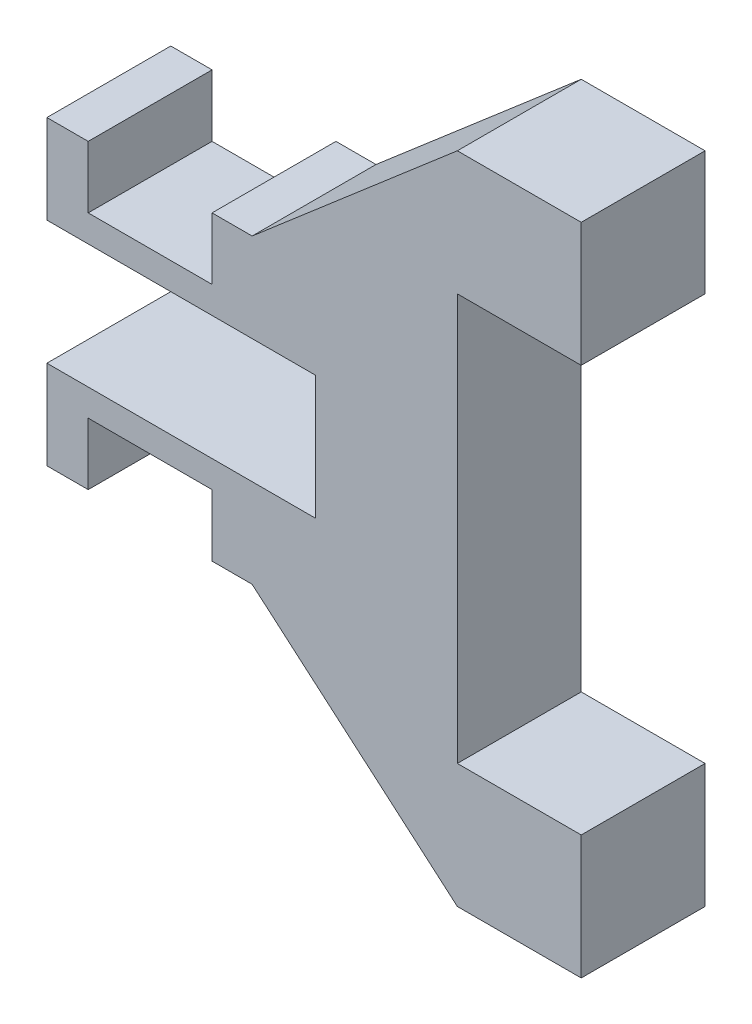
ISO-10303-21;
HEADER;
FILE_DESCRIPTION(('STEP AP214'),'2;1');
FILE_NAME('part.step','',(''),(''),'','','');
FILE_SCHEMA(('AUTOMOTIVE_DESIGN { 1 0 10303 214 1 1 1 1 }'));
ENDSEC;
DATA;
#1=APPLICATION_CONTEXT('core data for automotive mechanical design processes');
#2=APPLICATION_PROTOCOL_DEFINITION('international standard','automotive_design',2000,#1);
#3=PRODUCT_CONTEXT('',#1,'mechanical');
#4=PRODUCT('Part','Part','',(#3));
#5=PRODUCT_RELATED_PRODUCT_CATEGORY('part','',(#4));
#6=PRODUCT_DEFINITION_FORMATION('','',#4);
#7=PRODUCT_DEFINITION_CONTEXT('part definition',#1,'design');
#8=PRODUCT_DEFINITION('design','',#6,#7);
#9=PRODUCT_DEFINITION_SHAPE('','',#8);
#10=(LENGTH_UNIT() NAMED_UNIT(*) SI_UNIT(.MILLI.,.METRE.));
#11=(NAMED_UNIT(*) PLANE_ANGLE_UNIT() SI_UNIT($,.RADIAN.));
#12=(NAMED_UNIT(*) SI_UNIT($,.STERADIAN.) SOLID_ANGLE_UNIT());
#13=UNCERTAINTY_MEASURE_WITH_UNIT(LENGTH_MEASURE(1.E-05),#10,'distance_accuracy_value','');
#14=(GEOMETRIC_REPRESENTATION_CONTEXT(3) GLOBAL_UNCERTAINTY_ASSIGNED_CONTEXT((#13)) GLOBAL_UNIT_ASSIGNED_CONTEXT((#10,
#11,#12)) REPRESENTATION_CONTEXT('',''));
#15=CARTESIAN_POINT('',(0.,0.,0.));
#16=DIRECTION('',(0.,0.,1.));
#17=DIRECTION('',(1.,0.,0.));
#18=AXIS2_PLACEMENT_3D('',#15,#16,#17);
#19=CARTESIAN_POINT('',(54.4121763941234,-2.61735760170723,1.524));
#20=DIRECTION('',(0.,1.,0.));
#21=DIRECTION('',(0.,0.,1.));
#22=AXIS2_PLACEMENT_3D('',#19,#20,#21);
#23=PLANE('',#22);
#24=DIRECTION('',(0.,0.,1.));
#25=VECTOR('',#24,1.);
#26=CARTESIAN_POINT('',(54.9201763941234,-2.61735760170723,0.));
#27=LINE('',#26,#25);
#28=CARTESIAN_POINT('',(54.9201763941234,-2.61735760170723,0.));
#29=VERTEX_POINT('',#28);
#30=CARTESIAN_POINT('',(54.9201763941234,-2.61735760170723,1.524));
#31=VERTEX_POINT('',#30);
#32=EDGE_CURVE('E368',#29,#31,#27,.T.);
#33=ORIENTED_EDGE('',*,*,#32,.T.);
#34=DIRECTION('',(1.,0.,0.));
#35=VECTOR('',#34,1.);
#36=CARTESIAN_POINT('',(54.4121763941234,-2.61735760170723,1.524));
#37=LINE('',#36,#35);
#38=CARTESIAN_POINT('',(54.4121763941234,-2.61735760170723,1.524));
#39=VERTEX_POINT('',#38);
#40=EDGE_CURVE('E251',#39,#31,#37,.T.);
#41=ORIENTED_EDGE('',*,*,#40,.F.);
#42=DIRECTION('',(0.,0.,-1.));
#43=VECTOR('',#42,1.);
#44=CARTESIAN_POINT('',(54.4121763941234,-2.61735760170723,1.524));
#45=LINE('',#44,#43);
#46=CARTESIAN_POINT('',(54.4121763941234,-2.61735760170723,0.));
#47=VERTEX_POINT('',#46);
#48=EDGE_CURVE('E40',#39,#47,#45,.T.);
#49=ORIENTED_EDGE('',*,*,#48,.T.);
#50=DIRECTION('',(1.,0.,0.));
#51=VECTOR('',#50,1.);
#52=CARTESIAN_POINT('',(54.4121763941234,-2.61735760170723,0.));
#53=LINE('',#52,#51);
#54=EDGE_CURVE('E287',#47,#29,#53,.T.);
#55=ORIENTED_EDGE('',*,*,#54,.T.);
#56=EDGE_LOOP('',(#33,#41,#49,#55));
#57=FACE_BOUND('',#56,.T.);
#58=ADVANCED_FACE('F32',(#57),#23,.F.);
#59=DIRECTION('',(0.,0.,-1.));
#60=VECTOR('',#59,1.);
#61=CARTESIAN_POINT('',(56.4441763941234,-2.61735760170723,0.));
#62=LINE('',#61,#60);
#63=CARTESIAN_POINT('',(56.4441763941234,-2.61735760170723,1.524));
#64=VERTEX_POINT('',#63);
#65=CARTESIAN_POINT('',(56.4441763941234,-2.61735760170723,0.));
#66=VERTEX_POINT('',#65);
#67=EDGE_CURVE('E369',#64,#66,#62,.T.);
#68=ORIENTED_EDGE('',*,*,#67,.T.);
#69=CARTESIAN_POINT('',(56.9369583725451,-2.61735760170723,0.));
#70=VERTEX_POINT('',#69);
#71=EDGE_CURVE('E213',#66,#70,#53,.T.);
#72=ORIENTED_EDGE('',*,*,#71,.T.);
#73=DIRECTION('',(0.,0.,-1.));
#74=VECTOR('',#73,1.);
#75=CARTESIAN_POINT('',(56.9369583725451,-2.61735760170723,1.524));
#76=LINE('',#75,#74);
#77=CARTESIAN_POINT('',(56.9369583725451,-2.61735760170723,1.524));
#78=VERTEX_POINT('',#77);
#79=EDGE_CURVE('E355',#78,#70,#76,.T.);
#80=ORIENTED_EDGE('',*,*,#79,.F.);
#81=EDGE_CURVE('E250',#64,#78,#37,.T.);
#82=ORIENTED_EDGE('',*,*,#81,.F.);
#83=EDGE_LOOP('',(#68,#72,#80,#82));
#84=FACE_BOUND('',#83,.T.);
#85=ADVANCED_FACE('F461',(#84),#23,.F.);
#86=CARTESIAN_POINT('',(0.,0.,1.524));
#87=DIRECTION('',(0.,0.,1.));
#88=DIRECTION('',(1.,0.,0.));
#89=AXIS2_PLACEMENT_3D('',#86,#87,#88);
#90=PLANE('',#89);
#91=ORIENTED_EDGE('',*,*,#40,.T.);
#92=DIRECTION('',(0.,-1.,0.));
#93=VECTOR('',#92,1.);
#94=CARTESIAN_POINT('',(54.9201763941234,-1.85535760170723,1.524));
#95=LINE('',#94,#93);
#96=CARTESIAN_POINT('',(54.9201763941234,-1.85535760170723,1.524));
#97=VERTEX_POINT('',#96);
#98=EDGE_CURVE('E216',#97,#31,#95,.T.);
#99=ORIENTED_EDGE('',*,*,#98,.F.);
#100=DIRECTION('',(1.,0.,0.));
#101=VECTOR('',#100,1.);
#102=CARTESIAN_POINT('',(54.9201763941234,-1.85535760170723,1.524));
#103=LINE('',#102,#101);
#104=CARTESIAN_POINT('',(56.4441763941234,-1.85535760170723,1.524));
#105=VERTEX_POINT('',#104);
#106=EDGE_CURVE('E202',#97,#105,#103,.T.);
#107=ORIENTED_EDGE('',*,*,#106,.T.);
#108=DIRECTION('',(0.,-1.,0.));
#109=VECTOR('',#108,1.);
#110=CARTESIAN_POINT('',(56.4441763941234,-1.85535760170723,1.524));
#111=LINE('',#110,#109);
#112=EDGE_CURVE('E200',#105,#64,#111,.T.);
#113=ORIENTED_EDGE('',*,*,#112,.T.);
#114=ORIENTED_EDGE('',*,*,#81,.T.);
#115=DIRECTION('',(0.75832170522127,-0.651880503919472,0.));
#116=VECTOR('',#115,1.);
#117=CARTESIAN_POINT('',(56.9369583725451,-2.61735760170723,1.524));
#118=LINE('',#117,#116);
#119=CARTESIAN_POINT('',(59.4617403509667,-4.78775063812975,1.524));
#120=VERTEX_POINT('',#119);
#121=EDGE_CURVE('E254',#78,#120,#118,.T.);
#122=ORIENTED_EDGE('',*,*,#121,.T.);
#123=DIRECTION('',(1.,0.,0.));
#124=VECTOR('',#123,1.);
#125=CARTESIAN_POINT('',(59.4617403509667,-4.78775063812975,1.524));
#126=LINE('',#125,#124);
#127=CARTESIAN_POINT('',(60.9857403509667,-4.78775063812975,1.524));
#128=VERTEX_POINT('',#127);
#129=EDGE_CURVE('E256',#120,#128,#126,.T.);
#130=ORIENTED_EDGE('',*,*,#129,.T.);
#131=DIRECTION('',(0.,1.,0.));
#132=VECTOR('',#131,1.);
#133=CARTESIAN_POINT('',(60.9857403509667,-4.78775063812975,1.524));
#134=LINE('',#133,#132);
#135=CARTESIAN_POINT('',(60.9857403509667,-3.26375063812975,1.524));
#136=VERTEX_POINT('',#135);
#137=EDGE_CURVE('E258',#128,#136,#134,.T.);
#138=ORIENTED_EDGE('',*,*,#137,.T.);
#139=DIRECTION('',(-1.,0.,0.));
#140=VECTOR('',#139,1.);
#141=CARTESIAN_POINT('',(60.9857403509667,-3.26375063812975,1.524));
#142=LINE('',#141,#140);
#143=CARTESIAN_POINT('',(59.4617403509667,-3.26375063812975,1.524));
#144=VERTEX_POINT('',#143);
#145=EDGE_CURVE('E260',#136,#144,#142,.T.);
#146=ORIENTED_EDGE('',*,*,#145,.T.);
#147=DIRECTION('',(0.,1.,0.));
#148=VECTOR('',#147,1.);
#149=CARTESIAN_POINT('',(59.4617403509667,-3.26375063812975,1.524));
#150=LINE('',#149,#148);
#151=CARTESIAN_POINT('',(59.4617403509667,1.73975063812975,1.524));
#152=VERTEX_POINT('',#151);
#153=EDGE_CURVE('E262',#144,#152,#150,.T.);
#154=ORIENTED_EDGE('',*,*,#153,.T.);
#155=DIRECTION('',(1.,0.,0.));
#156=VECTOR('',#155,1.);
#157=CARTESIAN_POINT('',(60.9857403509667,1.73975063812975,1.524));
#158=LINE('',#157,#156);
#159=CARTESIAN_POINT('',(60.9857403509667,1.73975063812975,1.524));
#160=VERTEX_POINT('',#159);
#161=EDGE_CURVE('E264',#152,#160,#158,.T.);
#162=ORIENTED_EDGE('',*,*,#161,.T.);
#163=DIRECTION('',(0.,1.,0.));
#164=VECTOR('',#163,1.);
#165=CARTESIAN_POINT('',(60.9857403509667,3.26375063812975,1.524));
#166=LINE('',#165,#164);
#167=CARTESIAN_POINT('',(60.9857403509667,3.26375063812975,1.524));
#168=VERTEX_POINT('',#167);
#169=EDGE_CURVE('E266',#160,#168,#166,.T.);
#170=ORIENTED_EDGE('',*,*,#169,.T.);
#171=DIRECTION('',(-1.,0.,0.));
#172=VECTOR('',#171,1.);
#173=CARTESIAN_POINT('',(59.4617403509667,3.26375063812975,1.524));
#174=LINE('',#173,#172);
#175=CARTESIAN_POINT('',(59.4617403509667,3.26375063812975,1.524));
#176=VERTEX_POINT('',#175);
#177=EDGE_CURVE('E268',#168,#176,#174,.T.);
#178=ORIENTED_EDGE('',*,*,#177,.T.);
#179=DIRECTION('',(-0.758321705221271,-0.651880503919472,0.));
#180=VECTOR('',#179,1.);
#181=CARTESIAN_POINT('',(56.9369583725451,1.09335760170723,1.524));
#182=LINE('',#181,#180);
#183=CARTESIAN_POINT('',(56.9369583725451,1.09335760170723,1.524));
#184=VERTEX_POINT('',#183);
#185=EDGE_CURVE('E270',#176,#184,#182,.T.);
#186=ORIENTED_EDGE('',*,*,#185,.T.);
#187=DIRECTION('',(-1.,0.,0.));
#188=VECTOR('',#187,1.);
#189=CARTESIAN_POINT('',(54.4121763941234,1.09335760170723,1.524));
#190=LINE('',#189,#188);
#191=CARTESIAN_POINT('',(56.4441763941234,1.09335760170723,1.524));
#192=VERTEX_POINT('',#191);
#193=EDGE_CURVE('E273',#184,#192,#190,.T.);
#194=ORIENTED_EDGE('',*,*,#193,.T.);
#195=DIRECTION('',(0.,1.,0.));
#196=VECTOR('',#195,1.);
#197=CARTESIAN_POINT('',(56.4441763941234,0.331357601707228,1.524));
#198=LINE('',#197,#196);
#199=CARTESIAN_POINT('',(56.4441763941234,0.331357601707228,1.524));
#200=VERTEX_POINT('',#199);
#201=EDGE_CURVE('E240',#200,#192,#198,.T.);
#202=ORIENTED_EDGE('',*,*,#201,.F.);
#203=DIRECTION('',(1.,0.,0.));
#204=VECTOR('',#203,1.);
#205=CARTESIAN_POINT('',(54.9201763941234,0.331357601707228,1.524));
#206=LINE('',#205,#204);
#207=CARTESIAN_POINT('',(54.9201763941234,0.331357601707228,1.524));
#208=VERTEX_POINT('',#207);
#209=EDGE_CURVE('E224',#208,#200,#206,.T.);
#210=ORIENTED_EDGE('',*,*,#209,.F.);
#211=DIRECTION('',(0.,1.,0.));
#212=VECTOR('',#211,1.);
#213=CARTESIAN_POINT('',(54.9201763941234,0.331357601707228,1.524));
#214=LINE('',#213,#212);
#215=CARTESIAN_POINT('',(54.9201763941234,1.09335760170723,1.524));
#216=VERTEX_POINT('',#215);
#217=EDGE_CURVE('E230',#208,#216,#214,.T.);
#218=ORIENTED_EDGE('',*,*,#217,.T.);
#219=CARTESIAN_POINT('',(54.4121763941234,1.09335760170723,1.524));
#220=VERTEX_POINT('',#219);
#221=EDGE_CURVE('E272',#216,#220,#190,.T.);
#222=ORIENTED_EDGE('',*,*,#221,.T.);
#223=DIRECTION('',(0.,-1.,0.));
#224=VECTOR('',#223,1.);
#225=CARTESIAN_POINT('',(54.4121763941234,0.,1.524));
#226=LINE('',#225,#224);
#227=CARTESIAN_POINT('',(54.4121763941234,0.,1.524));
#228=VERTEX_POINT('',#227);
#229=EDGE_CURVE('E276',#220,#228,#226,.T.);
#230=ORIENTED_EDGE('',*,*,#229,.T.);
#231=DIRECTION('',(1.,0.,0.));
#232=VECTOR('',#231,1.);
#233=CARTESIAN_POINT('',(57.7184356935179,0.,1.524));
#234=LINE('',#233,#232);
#235=CARTESIAN_POINT('',(57.7184356935179,0.,1.524));
#236=VERTEX_POINT('',#235);
#237=EDGE_CURVE('E278',#228,#236,#234,.T.);
#238=ORIENTED_EDGE('',*,*,#237,.T.);
#239=DIRECTION('',(0.,-1.,0.));
#240=VECTOR('',#239,1.);
#241=CARTESIAN_POINT('',(57.7184356935179,0.,1.524));
#242=LINE('',#241,#240);
#243=CARTESIAN_POINT('',(57.7184356935179,-1.524,1.524));
#244=VERTEX_POINT('',#243);
#245=EDGE_CURVE('E280',#236,#244,#242,.T.);
#246=ORIENTED_EDGE('',*,*,#245,.T.);
#247=DIRECTION('',(-1.,0.,0.));
#248=VECTOR('',#247,1.);
#249=CARTESIAN_POINT('',(57.7184356935179,-1.524,1.524));
#250=LINE('',#249,#248);
#251=CARTESIAN_POINT('',(54.4121763941234,-1.524,1.524));
#252=VERTEX_POINT('',#251);
#253=EDGE_CURVE('E244',#244,#252,#250,.T.);
#254=ORIENTED_EDGE('',*,*,#253,.T.);
#255=DIRECTION('',(0.,-1.,0.));
#256=VECTOR('',#255,1.);
#257=CARTESIAN_POINT('',(54.4121763941234,-1.524,1.524));
#258=LINE('',#257,#256);
#259=EDGE_CURVE('E247',#252,#39,#258,.T.);
#260=ORIENTED_EDGE('',*,*,#259,.T.);
#261=EDGE_LOOP('',(#91,#99,#107,#113,#114,#122,#130,#138,#146,#154,#162,#170,#178,#186,#194,
#202,#210,#218,#222,#230,#238,#246,#254,#260));
#262=FACE_BOUND('',#261,.T.);
#263=ADVANCED_FACE('F375',(#262),#90,.T.);
#264=CARTESIAN_POINT('',(0.,0.,0.));
#265=DIRECTION('',(0.,0.,1.));
#266=DIRECTION('',(1.,0.,0.));
#267=AXIS2_PLACEMENT_3D('',#264,#265,#266);
#268=PLANE('',#267);
#269=DIRECTION('',(0.,-1.,0.));
#270=VECTOR('',#269,1.);
#271=CARTESIAN_POINT('',(54.9201763941234,-1.85535760170723,0.));
#272=LINE('',#271,#270);
#273=CARTESIAN_POINT('',(54.9201763941234,-1.85535760170723,0.));
#274=VERTEX_POINT('',#273);
#275=EDGE_CURVE('E214',#274,#29,#272,.T.);
#276=ORIENTED_EDGE('',*,*,#275,.T.);
#277=ORIENTED_EDGE('',*,*,#54,.F.);
#278=DIRECTION('',(0.,-1.,0.));
#279=VECTOR('',#278,1.);
#280=CARTESIAN_POINT('',(54.4121763941234,-1.524,0.));
#281=LINE('',#280,#279);
#282=CARTESIAN_POINT('',(54.4121763941234,-1.524,0.));
#283=VERTEX_POINT('',#282);
#284=EDGE_CURVE('E285',#283,#47,#281,.T.);
#285=ORIENTED_EDGE('',*,*,#284,.F.);
#286=DIRECTION('',(-1.,0.,0.));
#287=VECTOR('',#286,1.);
#288=CARTESIAN_POINT('',(57.7184356935179,-1.524,0.));
#289=LINE('',#288,#287);
#290=CARTESIAN_POINT('',(57.7184356935179,-1.524,0.));
#291=VERTEX_POINT('',#290);
#292=EDGE_CURVE('E236',#291,#283,#289,.T.);
#293=ORIENTED_EDGE('',*,*,#292,.F.);
#294=DIRECTION('',(0.,-1.,0.));
#295=VECTOR('',#294,1.);
#296=CARTESIAN_POINT('',(57.7184356935179,0.,0.));
#297=LINE('',#296,#295);
#298=CARTESIAN_POINT('',(57.7184356935179,0.,0.));
#299=VERTEX_POINT('',#298);
#300=EDGE_CURVE('E248',#299,#291,#297,.T.);
#301=ORIENTED_EDGE('',*,*,#300,.F.);
#302=DIRECTION('',(1.,0.,0.));
#303=VECTOR('',#302,1.);
#304=CARTESIAN_POINT('',(57.7184356935179,0.,0.));
#305=LINE('',#304,#303);
#306=CARTESIAN_POINT('',(54.4121763941234,0.,0.));
#307=VERTEX_POINT('',#306);
#308=EDGE_CURVE('E314',#307,#299,#305,.T.);
#309=ORIENTED_EDGE('',*,*,#308,.F.);
#310=DIRECTION('',(0.,-1.,0.));
#311=VECTOR('',#310,1.);
#312=CARTESIAN_POINT('',(54.4121763941234,0.,0.));
#313=LINE('',#312,#311);
#314=CARTESIAN_POINT('',(54.4121763941234,1.09335760170723,0.));
#315=VERTEX_POINT('',#314);
#316=EDGE_CURVE('E312',#315,#307,#313,.T.);
#317=ORIENTED_EDGE('',*,*,#316,.F.);
#318=DIRECTION('',(-1.,0.,0.));
#319=VECTOR('',#318,1.);
#320=CARTESIAN_POINT('',(54.4121763941234,1.09335760170723,0.));
#321=LINE('',#320,#319);
#322=CARTESIAN_POINT('',(54.9201763941234,1.09335760170723,0.));
#323=VERTEX_POINT('',#322);
#324=EDGE_CURVE('E308',#323,#315,#321,.T.);
#325=ORIENTED_EDGE('',*,*,#324,.F.);
#326=DIRECTION('',(0.,1.,0.));
#327=VECTOR('',#326,1.);
#328=CARTESIAN_POINT('',(54.9201763941234,0.331357601707228,0.));
#329=LINE('',#328,#327);
#330=CARTESIAN_POINT('',(54.9201763941234,0.331357601707228,0.));
#331=VERTEX_POINT('',#330);
#332=EDGE_CURVE('E234',#331,#323,#329,.T.);
#333=ORIENTED_EDGE('',*,*,#332,.F.);
#334=DIRECTION('',(-1.,0.,0.));
#335=VECTOR('',#334,1.);
#336=CARTESIAN_POINT('',(54.9201763941234,0.331357601707228,0.));
#337=LINE('',#336,#335);
#338=CARTESIAN_POINT('',(56.4441763941234,0.331357601707228,0.));
#339=VERTEX_POINT('',#338);
#340=EDGE_CURVE('E228',#339,#331,#337,.T.);
#341=ORIENTED_EDGE('',*,*,#340,.F.);
#342=DIRECTION('',(0.,1.,0.));
#343=VECTOR('',#342,1.);
#344=CARTESIAN_POINT('',(56.4441763941234,0.331357601707228,0.));
#345=LINE('',#344,#343);
#346=CARTESIAN_POINT('',(56.4441763941234,1.09335760170723,0.));
#347=VERTEX_POINT('',#346);
#348=EDGE_CURVE('E237',#339,#347,#345,.T.);
#349=ORIENTED_EDGE('',*,*,#348,.T.);
#350=CARTESIAN_POINT('',(56.9369583725451,1.09335760170723,0.));
#351=VERTEX_POINT('',#350);
#352=EDGE_CURVE('E309',#351,#347,#321,.T.);
#353=ORIENTED_EDGE('',*,*,#352,.F.);
#354=DIRECTION('',(-0.758321705221271,-0.651880503919472,0.));
#355=VECTOR('',#354,1.);
#356=CARTESIAN_POINT('',(56.9369583725451,1.09335760170723,0.));
#357=LINE('',#356,#355);
#358=CARTESIAN_POINT('',(59.4617403509667,3.26375063812975,0.));
#359=VERTEX_POINT('',#358);
#360=EDGE_CURVE('E306',#359,#351,#357,.T.);
#361=ORIENTED_EDGE('',*,*,#360,.F.);
#362=DIRECTION('',(-1.,0.,0.));
#363=VECTOR('',#362,1.);
#364=CARTESIAN_POINT('',(59.4617403509667,3.26375063812975,0.));
#365=LINE('',#364,#363);
#366=CARTESIAN_POINT('',(60.9857403509667,3.26375063812975,0.));
#367=VERTEX_POINT('',#366);
#368=EDGE_CURVE('E304',#367,#359,#365,.T.);
#369=ORIENTED_EDGE('',*,*,#368,.F.);
#370=DIRECTION('',(0.,1.,0.));
#371=VECTOR('',#370,1.);
#372=CARTESIAN_POINT('',(60.9857403509667,3.26375063812975,0.));
#373=LINE('',#372,#371);
#374=CARTESIAN_POINT('',(60.9857403509667,1.73975063812975,0.));
#375=VERTEX_POINT('',#374);
#376=EDGE_CURVE('E302',#375,#367,#373,.T.);
#377=ORIENTED_EDGE('',*,*,#376,.F.);
#378=DIRECTION('',(1.,0.,0.));
#379=VECTOR('',#378,1.);
#380=CARTESIAN_POINT('',(60.9857403509667,1.73975063812975,0.));
#381=LINE('',#380,#379);
#382=CARTESIAN_POINT('',(59.4617403509667,1.73975063812975,0.));
#383=VERTEX_POINT('',#382);
#384=EDGE_CURVE('E300',#383,#375,#381,.T.);
#385=ORIENTED_EDGE('',*,*,#384,.F.);
#386=DIRECTION('',(0.,1.,0.));
#387=VECTOR('',#386,1.);
#388=CARTESIAN_POINT('',(59.4617403509667,-3.26375063812975,0.));
#389=LINE('',#388,#387);
#390=CARTESIAN_POINT('',(59.4617403509667,-3.26375063812975,0.));
#391=VERTEX_POINT('',#390);
#392=EDGE_CURVE('E298',#391,#383,#389,.T.);
#393=ORIENTED_EDGE('',*,*,#392,.F.);
#394=DIRECTION('',(-1.,0.,0.));
#395=VECTOR('',#394,1.);
#396=CARTESIAN_POINT('',(60.9857403509667,-3.26375063812975,0.));
#397=LINE('',#396,#395);
#398=CARTESIAN_POINT('',(60.9857403509667,-3.26375063812975,0.));
#399=VERTEX_POINT('',#398);
#400=EDGE_CURVE('E296',#399,#391,#397,.T.);
#401=ORIENTED_EDGE('',*,*,#400,.F.);
#402=DIRECTION('',(0.,1.,0.));
#403=VECTOR('',#402,1.);
#404=CARTESIAN_POINT('',(60.9857403509667,-4.78775063812975,0.));
#405=LINE('',#404,#403);
#406=CARTESIAN_POINT('',(60.9857403509667,-4.78775063812975,0.));
#407=VERTEX_POINT('',#406);
#408=EDGE_CURVE('E294',#407,#399,#405,.T.);
#409=ORIENTED_EDGE('',*,*,#408,.F.);
#410=DIRECTION('',(1.,0.,0.));
#411=VECTOR('',#410,1.);
#412=CARTESIAN_POINT('',(59.4617403509667,-4.78775063812975,0.));
#413=LINE('',#412,#411);
#414=CARTESIAN_POINT('',(59.4617403509667,-4.78775063812975,0.));
#415=VERTEX_POINT('',#414);
#416=EDGE_CURVE('E292',#415,#407,#413,.T.);
#417=ORIENTED_EDGE('',*,*,#416,.F.);
#418=DIRECTION('',(0.75832170522127,-0.651880503919472,0.));
#419=VECTOR('',#418,1.);
#420=CARTESIAN_POINT('',(56.9369583725451,-2.61735760170723,0.));
#421=LINE('',#420,#419);
#422=EDGE_CURVE('E290',#70,#415,#421,.T.);
#423=ORIENTED_EDGE('',*,*,#422,.F.);
#424=ORIENTED_EDGE('',*,*,#71,.F.);
#425=DIRECTION('',(0.,-1.,0.));
#426=VECTOR('',#425,1.);
#427=CARTESIAN_POINT('',(56.4441763941234,-1.85535760170723,0.));
#428=LINE('',#427,#426);
#429=CARTESIAN_POINT('',(56.4441763941234,-1.85535760170723,0.));
#430=VERTEX_POINT('',#429);
#431=EDGE_CURVE('E197',#430,#66,#428,.T.);
#432=ORIENTED_EDGE('',*,*,#431,.F.);
#433=DIRECTION('',(-1.,0.,0.));
#434=VECTOR('',#433,1.);
#435=CARTESIAN_POINT('',(54.9201763941234,-1.85535760170723,0.));
#436=LINE('',#435,#434);
#437=EDGE_CURVE('E203',#430,#274,#436,.T.);
#438=ORIENTED_EDGE('',*,*,#437,.T.);
#439=EDGE_LOOP('',(#276,#277,#285,#293,#301,#309,#317,#325,#333,#341,#349,#353,#361,#369,#377,
#385,#393,#401,#409,#417,#423,#424,#432,#438));
#440=FACE_BOUND('',#439,.T.);
#441=ADVANCED_FACE('F211',(#440),#268,.F.);
#442=CARTESIAN_POINT('',(54.4121763941234,1.09335760170723,1.524));
#443=DIRECTION('',(0.,-1.,0.));
#444=DIRECTION('',(1.,0.,0.));
#445=AXIS2_PLACEMENT_3D('',#442,#443,#444);
#446=PLANE('',#445);
#447=ORIENTED_EDGE('',*,*,#221,.F.);
#448=DIRECTION('',(0.,0.,1.));
#449=VECTOR('',#448,1.);
#450=CARTESIAN_POINT('',(54.9201763941234,1.09335760170723,0.));
#451=LINE('',#450,#449);
#452=EDGE_CURVE('E231',#323,#216,#451,.T.);
#453=ORIENTED_EDGE('',*,*,#452,.F.);
#454=ORIENTED_EDGE('',*,*,#324,.T.);
#455=DIRECTION('',(0.,0.,-1.));
#456=VECTOR('',#455,1.);
#457=CARTESIAN_POINT('',(54.4121763941234,1.09335760170723,1.524));
#458=LINE('',#457,#456);
#459=EDGE_CURVE('E325',#220,#315,#458,.T.);
#460=ORIENTED_EDGE('',*,*,#459,.F.);
#461=EDGE_LOOP('',(#447,#453,#454,#460));
#462=FACE_BOUND('',#461,.T.);
#463=ADVANCED_FACE('F403',(#462),#446,.F.);
#464=CARTESIAN_POINT('',(57.7184356935179,-1.524,1.524));
#465=DIRECTION('',(0.,-1.,0.));
#466=DIRECTION('',(0.,0.,-1.));
#467=AXIS2_PLACEMENT_3D('',#464,#465,#466);
#468=PLANE('',#467);
#469=ORIENTED_EDGE('',*,*,#292,.T.);
#470=DIRECTION('',(0.,0.,-1.));
#471=VECTOR('',#470,1.);
#472=CARTESIAN_POINT('',(54.4121763941234,-1.524,1.524));
#473=LINE('',#472,#471);
#474=EDGE_CURVE('E11',#252,#283,#473,.T.);
#475=ORIENTED_EDGE('',*,*,#474,.F.);
#476=ORIENTED_EDGE('',*,*,#253,.F.);
#477=DIRECTION('',(0.,0.,-1.));
#478=VECTOR('',#477,1.);
#479=CARTESIAN_POINT('',(57.7184356935179,-1.524,1.524));
#480=LINE('',#479,#478);
#481=EDGE_CURVE('E282',#244,#291,#480,.T.);
#482=ORIENTED_EDGE('',*,*,#481,.T.);
#483=EDGE_LOOP('',(#469,#475,#476,#482));
#484=FACE_BOUND('',#483,.T.);
#485=ADVANCED_FACE('F34',(#484),#468,.F.);
#486=CARTESIAN_POINT('',(54.4121763941234,-1.524,1.524));
#487=DIRECTION('',(1.,0.,0.));
#488=DIRECTION('',(0.,0.,-1.));
#489=AXIS2_PLACEMENT_3D('',#486,#487,#488);
#490=PLANE('',#489);
#491=ORIENTED_EDGE('',*,*,#284,.T.);
#492=ORIENTED_EDGE('',*,*,#48,.F.);
#493=ORIENTED_EDGE('',*,*,#259,.F.);
#494=ORIENTED_EDGE('',*,*,#474,.T.);
#495=EDGE_LOOP('',(#491,#492,#493,#494));
#496=FACE_BOUND('',#495,.T.);
#497=ADVANCED_FACE('F379',(#496),#490,.F.);
#498=CARTESIAN_POINT('',(56.9369583725451,-2.61735760170723,1.524));
#499=DIRECTION('',(0.651880503919472,0.75832170522127,0.));
#500=DIRECTION('',(-0.758321705221271,0.651880503919472,0.));
#501=AXIS2_PLACEMENT_3D('',#498,#499,#500);
#502=PLANE('',#501);
#503=ORIENTED_EDGE('',*,*,#422,.T.);
#504=DIRECTION('',(0.,0.,-1.));
#505=VECTOR('',#504,1.);
#506=CARTESIAN_POINT('',(59.4617403509667,-4.78775063812975,1.524));
#507=LINE('',#506,#505);
#508=EDGE_CURVE('E352',#120,#415,#507,.T.);
#509=ORIENTED_EDGE('',*,*,#508,.F.);
#510=ORIENTED_EDGE('',*,*,#121,.F.);
#511=ORIENTED_EDGE('',*,*,#79,.T.);
#512=EDGE_LOOP('',(#503,#509,#510,#511));
#513=FACE_BOUND('',#512,.T.);
#514=ADVANCED_FACE('F458',(#513),#502,.F.);
#515=CARTESIAN_POINT('',(59.4617403509667,-4.78775063812975,1.524));
#516=DIRECTION('',(0.,1.,0.));
#517=DIRECTION('',(0.,0.,1.));
#518=AXIS2_PLACEMENT_3D('',#515,#516,#517);
#519=PLANE('',#518);
#520=ORIENTED_EDGE('',*,*,#416,.T.);
#521=DIRECTION('',(0.,0.,-1.));
#522=VECTOR('',#521,1.);
#523=CARTESIAN_POINT('',(60.9857403509667,-4.78775063812975,1.524));
#524=LINE('',#523,#522);
#525=EDGE_CURVE('E349',#128,#407,#524,.T.);
#526=ORIENTED_EDGE('',*,*,#525,.F.);
#527=ORIENTED_EDGE('',*,*,#129,.F.);
#528=ORIENTED_EDGE('',*,*,#508,.T.);
#529=EDGE_LOOP('',(#520,#526,#527,#528));
#530=FACE_BOUND('',#529,.T.);
#531=ADVANCED_FACE('F453',(#530),#519,.F.);
#532=CARTESIAN_POINT('',(60.9857403509667,-4.78775063812975,1.524));
#533=DIRECTION('',(-1.,0.,0.));
#534=DIRECTION('',(0.,0.,1.));
#535=AXIS2_PLACEMENT_3D('',#532,#533,#534);
#536=PLANE('',#535);
#537=ORIENTED_EDGE('',*,*,#408,.T.);
#538=DIRECTION('',(0.,0.,-1.));
#539=VECTOR('',#538,1.);
#540=CARTESIAN_POINT('',(60.9857403509667,-3.26375063812975,1.524));
#541=LINE('',#540,#539);
#542=EDGE_CURVE('E346',#136,#399,#541,.T.);
#543=ORIENTED_EDGE('',*,*,#542,.F.);
#544=ORIENTED_EDGE('',*,*,#137,.F.);
#545=ORIENTED_EDGE('',*,*,#525,.T.);
#546=EDGE_LOOP('',(#537,#543,#544,#545));
#547=FACE_BOUND('',#546,.T.);
#548=ADVANCED_FACE('F449',(#547),#536,.F.);
#549=CARTESIAN_POINT('',(60.9857403509667,-3.26375063812975,1.524));
#550=DIRECTION('',(0.,-1.,0.));
#551=DIRECTION('',(0.,0.,-1.));
#552=AXIS2_PLACEMENT_3D('',#549,#550,#551);
#553=PLANE('',#552);
#554=ORIENTED_EDGE('',*,*,#400,.T.);
#555=DIRECTION('',(0.,0.,-1.));
#556=VECTOR('',#555,1.);
#557=CARTESIAN_POINT('',(59.4617403509667,-3.26375063812975,1.524));
#558=LINE('',#557,#556);
#559=EDGE_CURVE('E343',#144,#391,#558,.T.);
#560=ORIENTED_EDGE('',*,*,#559,.F.);
#561=ORIENTED_EDGE('',*,*,#145,.F.);
#562=ORIENTED_EDGE('',*,*,#542,.T.);
#563=EDGE_LOOP('',(#554,#560,#561,#562));
#564=FACE_BOUND('',#563,.T.);
#565=ADVANCED_FACE('F445',(#564),#553,.F.);
#566=CARTESIAN_POINT('',(59.4617403509667,-3.26375063812975,1.524));
#567=DIRECTION('',(-1.,0.,0.));
#568=DIRECTION('',(0.,0.,1.));
#569=AXIS2_PLACEMENT_3D('',#566,#567,#568);
#570=PLANE('',#569);
#571=ORIENTED_EDGE('',*,*,#392,.T.);
#572=DIRECTION('',(0.,0.,-1.));
#573=VECTOR('',#572,1.);
#574=CARTESIAN_POINT('',(59.4617403509667,1.73975063812975,1.524));
#575=LINE('',#574,#573);
#576=EDGE_CURVE('E340',#152,#383,#575,.T.);
#577=ORIENTED_EDGE('',*,*,#576,.F.);
#578=ORIENTED_EDGE('',*,*,#153,.F.);
#579=ORIENTED_EDGE('',*,*,#559,.T.);
#580=EDGE_LOOP('',(#571,#577,#578,#579));
#581=FACE_BOUND('',#580,.T.);
#582=ADVANCED_FACE('F440',(#581),#570,.F.);
#583=CARTESIAN_POINT('',(60.9857403509667,1.73975063812975,1.524));
#584=DIRECTION('',(0.,1.,0.));
#585=DIRECTION('',(-1.,0.,0.));
#586=AXIS2_PLACEMENT_3D('',#583,#584,#585);
#587=PLANE('',#586);
#588=ORIENTED_EDGE('',*,*,#384,.T.);
#589=DIRECTION('',(0.,0.,-1.));
#590=VECTOR('',#589,1.);
#591=CARTESIAN_POINT('',(60.9857403509667,1.73975063812975,1.524));
#592=LINE('',#591,#590);
#593=EDGE_CURVE('E337',#160,#375,#592,.T.);
#594=ORIENTED_EDGE('',*,*,#593,.F.);
#595=ORIENTED_EDGE('',*,*,#161,.F.);
#596=ORIENTED_EDGE('',*,*,#576,.T.);
#597=EDGE_LOOP('',(#588,#594,#595,#596));
#598=FACE_BOUND('',#597,.T.);
#599=ADVANCED_FACE('F434',(#598),#587,.F.);
#600=CARTESIAN_POINT('',(60.9857403509667,3.26375063812975,1.524));
#601=DIRECTION('',(-1.,0.,0.));
#602=DIRECTION('',(0.,0.,1.));
#603=AXIS2_PLACEMENT_3D('',#600,#601,#602);
#604=PLANE('',#603);
#605=ORIENTED_EDGE('',*,*,#376,.T.);
#606=DIRECTION('',(0.,0.,-1.));
#607=VECTOR('',#606,1.);
#608=CARTESIAN_POINT('',(60.9857403509667,3.26375063812975,1.524));
#609=LINE('',#608,#607);
#610=EDGE_CURVE('E334',#168,#367,#609,.T.);
#611=ORIENTED_EDGE('',*,*,#610,.F.);
#612=ORIENTED_EDGE('',*,*,#169,.F.);
#613=ORIENTED_EDGE('',*,*,#593,.T.);
#614=EDGE_LOOP('',(#605,#611,#612,#613));
#615=FACE_BOUND('',#614,.T.);
#616=ADVANCED_FACE('F430',(#615),#604,.F.);
#617=CARTESIAN_POINT('',(59.4617403509667,3.26375063812975,1.524));
#618=DIRECTION('',(0.,-1.,0.));
#619=DIRECTION('',(0.,0.,-1.));
#620=AXIS2_PLACEMENT_3D('',#617,#618,#619);
#621=PLANE('',#620);
#622=ORIENTED_EDGE('',*,*,#368,.T.);
#623=DIRECTION('',(0.,0.,-1.));
#624=VECTOR('',#623,1.);
#625=CARTESIAN_POINT('',(59.4617403509667,3.26375063812975,1.524));
#626=LINE('',#625,#624);
#627=EDGE_CURVE('E331',#176,#359,#626,.T.);
#628=ORIENTED_EDGE('',*,*,#627,.F.);
#629=ORIENTED_EDGE('',*,*,#177,.F.);
#630=ORIENTED_EDGE('',*,*,#610,.T.);
#631=EDGE_LOOP('',(#622,#628,#629,#630));
#632=FACE_BOUND('',#631,.T.);
#633=ADVANCED_FACE('F425',(#632),#621,.F.);
#634=CARTESIAN_POINT('',(56.9369583725451,1.09335760170723,1.524));
#635=DIRECTION('',(0.651880503919472,-0.758321705221271,0.));
#636=DIRECTION('',(0.758321705221271,0.651880503919472,0.));
#637=AXIS2_PLACEMENT_3D('',#634,#635,#636);
#638=PLANE('',#637);
#639=ORIENTED_EDGE('',*,*,#360,.T.);
#640=DIRECTION('',(0.,0.,-1.));
#641=VECTOR('',#640,1.);
#642=CARTESIAN_POINT('',(56.9369583725451,1.09335760170723,1.524));
#643=LINE('',#642,#641);
#644=EDGE_CURVE('E328',#184,#351,#643,.T.);
#645=ORIENTED_EDGE('',*,*,#644,.F.);
#646=ORIENTED_EDGE('',*,*,#185,.F.);
#647=ORIENTED_EDGE('',*,*,#627,.T.);
#648=EDGE_LOOP('',(#639,#645,#646,#647));
#649=FACE_BOUND('',#648,.T.);
#650=ADVANCED_FACE('F419',(#649),#638,.F.);
#651=ORIENTED_EDGE('',*,*,#352,.T.);
#652=DIRECTION('',(0.,0.,-1.));
#653=VECTOR('',#652,1.);
#654=CARTESIAN_POINT('',(56.4441763941234,1.09335760170723,0.));
#655=LINE('',#654,#653);
#656=EDGE_CURVE('E225',#192,#347,#655,.T.);
#657=ORIENTED_EDGE('',*,*,#656,.F.);
#658=ORIENTED_EDGE('',*,*,#193,.F.);
#659=ORIENTED_EDGE('',*,*,#644,.T.);
#660=EDGE_LOOP('',(#651,#657,#658,#659));
#661=FACE_BOUND('',#660,.T.);
#662=ADVANCED_FACE('F414',(#661),#446,.F.);
#663=CARTESIAN_POINT('',(54.4121763941234,0.,1.524));
#664=DIRECTION('',(1.,0.,0.));
#665=DIRECTION('',(0.,0.,-1.));
#666=AXIS2_PLACEMENT_3D('',#663,#664,#665);
#667=PLANE('',#666);
#668=ORIENTED_EDGE('',*,*,#316,.T.);
#669=DIRECTION('',(0.,0.,-1.));
#670=VECTOR('',#669,1.);
#671=CARTESIAN_POINT('',(54.4121763941234,0.,1.524));
#672=LINE('',#671,#670);
#673=EDGE_CURVE('E322',#228,#307,#672,.T.);
#674=ORIENTED_EDGE('',*,*,#673,.F.);
#675=ORIENTED_EDGE('',*,*,#229,.F.);
#676=ORIENTED_EDGE('',*,*,#459,.T.);
#677=EDGE_LOOP('',(#668,#674,#675,#676));
#678=FACE_BOUND('',#677,.T.);
#679=ADVANCED_FACE('F395',(#678),#667,.F.);
#680=CARTESIAN_POINT('',(57.7184356935179,0.,1.524));
#681=DIRECTION('',(0.,1.,0.));
#682=DIRECTION('',(-1.,0.,0.));
#683=AXIS2_PLACEMENT_3D('',#680,#681,#682);
#684=PLANE('',#683);
#685=ORIENTED_EDGE('',*,*,#308,.T.);
#686=DIRECTION('',(0.,0.,-1.));
#687=VECTOR('',#686,1.);
#688=CARTESIAN_POINT('',(57.7184356935179,0.,1.524));
#689=LINE('',#688,#687);
#690=EDGE_CURVE('E319',#236,#299,#689,.T.);
#691=ORIENTED_EDGE('',*,*,#690,.F.);
#692=ORIENTED_EDGE('',*,*,#237,.F.);
#693=ORIENTED_EDGE('',*,*,#673,.T.);
#694=EDGE_LOOP('',(#685,#691,#692,#693));
#695=FACE_BOUND('',#694,.T.);
#696=ADVANCED_FACE('F391',(#695),#684,.F.);
#697=CARTESIAN_POINT('',(57.7184356935179,0.,1.524));
#698=DIRECTION('',(1.,0.,0.));
#699=DIRECTION('',(0.,0.,-1.));
#700=AXIS2_PLACEMENT_3D('',#697,#698,#699);
#701=PLANE('',#700);
#702=ORIENTED_EDGE('',*,*,#300,.T.);
#703=ORIENTED_EDGE('',*,*,#481,.F.);
#704=ORIENTED_EDGE('',*,*,#245,.F.);
#705=ORIENTED_EDGE('',*,*,#690,.T.);
#706=EDGE_LOOP('',(#702,#703,#704,#705));
#707=FACE_BOUND('',#706,.T.);
#708=ADVANCED_FACE('F386',(#707),#701,.F.);
#709=CARTESIAN_POINT('',(54.9201763941234,0.331357601707228,0.));
#710=DIRECTION('',(-1.,0.,0.));
#711=DIRECTION('',(0.,-1.,0.));
#712=AXIS2_PLACEMENT_3D('',#709,#710,#711);
#713=PLANE('',#712);
#714=ORIENTED_EDGE('',*,*,#452,.T.);
#715=ORIENTED_EDGE('',*,*,#217,.F.);
#716=DIRECTION('',(0.,0.,1.));
#717=VECTOR('',#716,1.);
#718=CARTESIAN_POINT('',(54.9201763941234,0.331357601707228,0.));
#719=LINE('',#718,#717);
#720=EDGE_CURVE('E221',#331,#208,#719,.T.);
#721=ORIENTED_EDGE('',*,*,#720,.F.);
#722=ORIENTED_EDGE('',*,*,#332,.T.);
#723=EDGE_LOOP('',(#714,#715,#721,#722));
#724=FACE_BOUND('',#723,.T.);
#725=ADVANCED_FACE('F405',(#724),#713,.F.);
#726=CARTESIAN_POINT('',(56.4441763941234,0.331357601707228,0.));
#727=DIRECTION('',(1.,0.,0.));
#728=DIRECTION('',(0.,1.,0.));
#729=AXIS2_PLACEMENT_3D('',#726,#727,#728);
#730=PLANE('',#729);
#731=ORIENTED_EDGE('',*,*,#656,.T.);
#732=ORIENTED_EDGE('',*,*,#348,.F.);
#733=DIRECTION('',(0.,0.,-1.));
#734=VECTOR('',#733,1.);
#735=CARTESIAN_POINT('',(56.4441763941234,0.331357601707228,0.));
#736=LINE('',#735,#734);
#737=EDGE_CURVE('E55',#200,#339,#736,.T.);
#738=ORIENTED_EDGE('',*,*,#737,.F.);
#739=ORIENTED_EDGE('',*,*,#201,.T.);
#740=EDGE_LOOP('',(#731,#732,#738,#739));
#741=FACE_BOUND('',#740,.T.);
#742=ADVANCED_FACE('F577',(#741),#730,.F.);
#743=CARTESIAN_POINT('',(0.,0.331357601707252,0.));
#744=DIRECTION('',(0.,1.,0.));
#745=DIRECTION('',(-1.,0.,0.));
#746=AXIS2_PLACEMENT_3D('',#743,#744,#745);
#747=PLANE('',#746);
#748=ORIENTED_EDGE('',*,*,#720,.T.);
#749=ORIENTED_EDGE('',*,*,#209,.T.);
#750=ORIENTED_EDGE('',*,*,#737,.T.);
#751=ORIENTED_EDGE('',*,*,#340,.T.);
#752=EDGE_LOOP('',(#748,#749,#750,#751));
#753=FACE_BOUND('',#752,.T.);
#754=ADVANCED_FACE('F408',(#753),#747,.T.);
#755=CARTESIAN_POINT('',(54.9201763941234,-1.85535760170723,0.));
#756=DIRECTION('',(1.,0.,0.));
#757=DIRECTION('',(0.,0.,-1.));
#758=AXIS2_PLACEMENT_3D('',#755,#756,#757);
#759=PLANE('',#758);
#760=ORIENTED_EDGE('',*,*,#32,.F.);
#761=ORIENTED_EDGE('',*,*,#275,.F.);
#762=DIRECTION('',(0.,0.,1.));
#763=VECTOR('',#762,1.);
#764=CARTESIAN_POINT('',(54.9201763941234,-1.85535760170723,0.));
#765=LINE('',#764,#763);
#766=EDGE_CURVE('E47',#274,#97,#765,.T.);
#767=ORIENTED_EDGE('',*,*,#766,.T.);
#768=ORIENTED_EDGE('',*,*,#98,.T.);
#769=EDGE_LOOP('',(#760,#761,#767,#768));
#770=FACE_BOUND('',#769,.T.);
#771=ADVANCED_FACE('F366',(#770),#759,.T.);
#772=CARTESIAN_POINT('',(56.4441763941234,-1.85535760170723,0.));
#773=DIRECTION('',(-1.,0.,0.));
#774=DIRECTION('',(0.,0.,1.));
#775=AXIS2_PLACEMENT_3D('',#772,#773,#774);
#776=PLANE('',#775);
#777=ORIENTED_EDGE('',*,*,#67,.F.);
#778=ORIENTED_EDGE('',*,*,#112,.F.);
#779=DIRECTION('',(0.,0.,-1.));
#780=VECTOR('',#779,1.);
#781=CARTESIAN_POINT('',(56.4441763941234,-1.85535760170723,0.));
#782=LINE('',#781,#780);
#783=EDGE_CURVE('E194',#105,#430,#782,.T.);
#784=ORIENTED_EDGE('',*,*,#783,.T.);
#785=ORIENTED_EDGE('',*,*,#431,.T.);
#786=EDGE_LOOP('',(#777,#778,#784,#785));
#787=FACE_BOUND('',#786,.T.);
#788=ADVANCED_FACE('F195',(#787),#776,.T.);
#789=CARTESIAN_POINT('',(0.,-1.85535760170722,0.));
#790=DIRECTION('',(0.,-1.,0.));
#791=DIRECTION('',(-1.,0.,0.));
#792=AXIS2_PLACEMENT_3D('',#789,#790,#791);
#793=PLANE('',#792);
#794=ORIENTED_EDGE('',*,*,#766,.F.);
#795=ORIENTED_EDGE('',*,*,#437,.F.);
#796=ORIENTED_EDGE('',*,*,#783,.F.);
#797=ORIENTED_EDGE('',*,*,#106,.F.);
#798=EDGE_LOOP('',(#794,#795,#796,#797));
#799=FACE_BOUND('',#798,.T.);
#800=ADVANCED_FACE('F206',(#799),#793,.T.);
#801=CLOSED_SHELL('',(#58,#85,#263,#441,#463,#485,#497,#514,#531,#548,#565,#582,#599,#616,#633,
#650,#662,#679,#696,#708,#725,#742,#754,#771,#788,#800));
#802=MANIFOLD_SOLID_BREP('B2',#801);
#803=ADVANCED_BREP_SHAPE_REPRESENTATION('',(#18,#802),#14);
#804=SHAPE_DEFINITION_REPRESENTATION(#9,#803);
ENDSEC;
END-ISO-10303-21;
